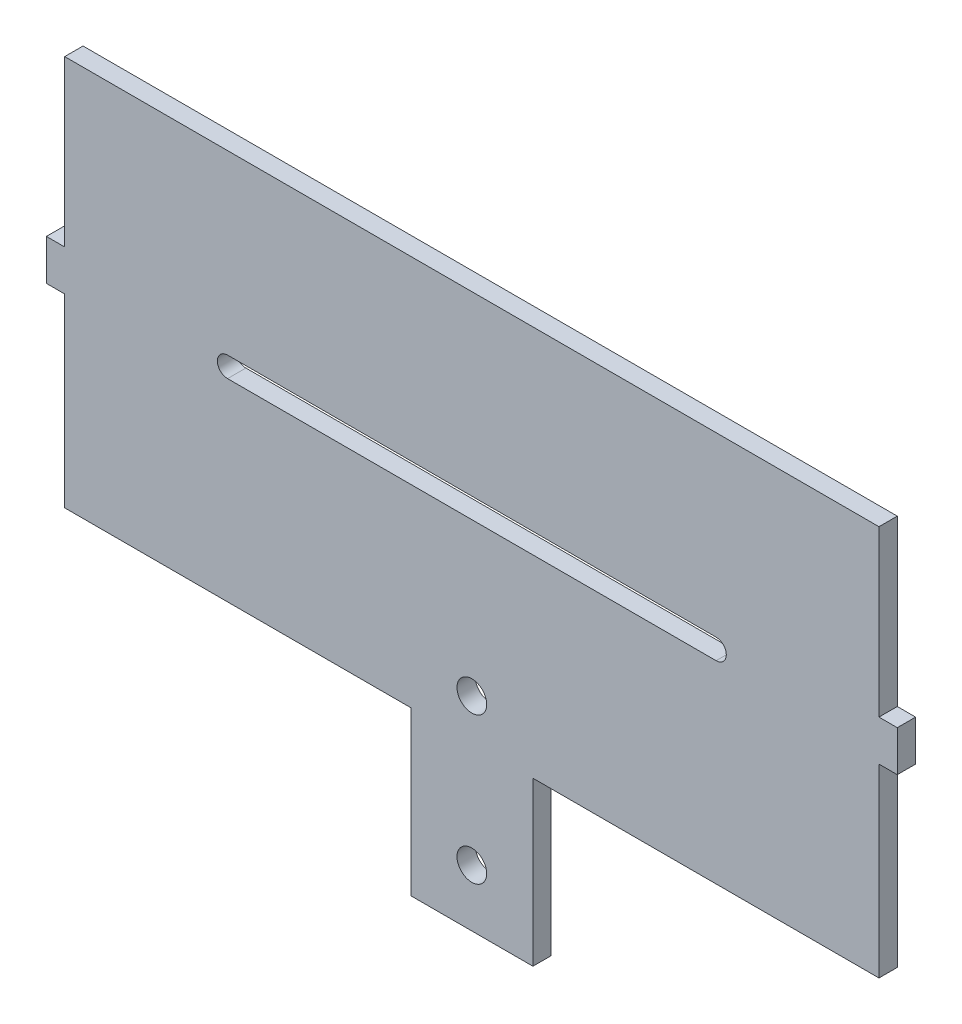
ISO-10303-21;
HEADER;
FILE_DESCRIPTION(('STEP AP214'),'2;1');
FILE_NAME('part.step','',(''),(''),'','','');
FILE_SCHEMA(('AUTOMOTIVE_DESIGN { 1 0 10303 214 1 1 1 1 }'));
ENDSEC;
DATA;
#1=APPLICATION_CONTEXT('core data for automotive mechanical design processes');
#2=APPLICATION_PROTOCOL_DEFINITION('international standard','automotive_design',2000,#1);
#3=PRODUCT_CONTEXT('',#1,'mechanical');
#4=PRODUCT('Part','Part','',(#3));
#5=PRODUCT_RELATED_PRODUCT_CATEGORY('part','',(#4));
#6=PRODUCT_DEFINITION_FORMATION('','',#4);
#7=PRODUCT_DEFINITION_CONTEXT('part definition',#1,'design');
#8=PRODUCT_DEFINITION('design','',#6,#7);
#9=PRODUCT_DEFINITION_SHAPE('','',#8);
#10=(LENGTH_UNIT() NAMED_UNIT(*) SI_UNIT(.MILLI.,.METRE.));
#11=(NAMED_UNIT(*) PLANE_ANGLE_UNIT() SI_UNIT($,.RADIAN.));
#12=(NAMED_UNIT(*) SI_UNIT($,.STERADIAN.) SOLID_ANGLE_UNIT());
#13=UNCERTAINTY_MEASURE_WITH_UNIT(LENGTH_MEASURE(1.E-05),#10,'distance_accuracy_value','');
#14=(GEOMETRIC_REPRESENTATION_CONTEXT(3) GLOBAL_UNCERTAINTY_ASSIGNED_CONTEXT((#13)) GLOBAL_UNIT_ASSIGNED_CONTEXT((#10,
#11,#12)) REPRESENTATION_CONTEXT('',''));
#15=CARTESIAN_POINT('',(0.,0.,0.));
#16=DIRECTION('',(0.,0.,1.));
#17=DIRECTION('',(1.,0.,0.));
#18=AXIS2_PLACEMENT_3D('',#15,#16,#17);
#19=CARTESIAN_POINT('',(127.,6.98499999999998,5.715));
#20=DIRECTION('',(-1.,0.,0.));
#21=DIRECTION('',(0.,0.,1.));
#22=AXIS2_PLACEMENT_3D('',#19,#20,#21);
#23=PLANE('',#22);
#24=DIRECTION('',(0.,1.,0.));
#25=VECTOR('',#24,1.);
#26=CARTESIAN_POINT('',(127.,6.98499999999998,0.));
#27=LINE('',#26,#25);
#28=CARTESIAN_POINT('',(127.,6.98499999999998,0.));
#29=VERTEX_POINT('',#28);
#30=CARTESIAN_POINT('',(127.,58.42,0.));
#31=VERTEX_POINT('',#30);
#32=EDGE_CURVE('E205',#29,#31,#27,.T.);
#33=ORIENTED_EDGE('',*,*,#32,.T.);
#34=DIRECTION('',(0.,0.,1.));
#35=VECTOR('',#34,1.);
#36=CARTESIAN_POINT('',(127.,58.42,0.));
#37=LINE('',#36,#35);
#38=CARTESIAN_POINT('',(127.,58.42,5.715));
#39=VERTEX_POINT('',#38);
#40=EDGE_CURVE('E60',#31,#39,#37,.T.);
#41=ORIENTED_EDGE('',*,*,#40,.T.);
#42=DIRECTION('',(0.,1.,0.));
#43=VECTOR('',#42,1.);
#44=CARTESIAN_POINT('',(127.,6.98499999999998,5.715));
#45=LINE('',#44,#43);
#46=CARTESIAN_POINT('',(127.,6.98499999999998,5.715));
#47=VERTEX_POINT('',#46);
#48=EDGE_CURVE('E252',#47,#39,#45,.T.);
#49=ORIENTED_EDGE('',*,*,#48,.F.);
#50=DIRECTION('',(0.,0.,-1.));
#51=VECTOR('',#50,1.);
#52=CARTESIAN_POINT('',(127.,6.98499999999998,5.715));
#53=LINE('',#52,#51);
#54=EDGE_CURVE('E253',#47,#29,#53,.T.);
#55=ORIENTED_EDGE('',*,*,#54,.T.);
#56=EDGE_LOOP('',(#33,#41,#49,#55));
#57=FACE_BOUND('',#56,.T.);
#58=ADVANCED_FACE('F45',(#57),#23,.F.);
#59=CARTESIAN_POINT('',(-127.,6.98499999999998,5.715));
#60=DIRECTION('',(1.,0.,0.));
#61=DIRECTION('',(0.,0.,-1.));
#62=AXIS2_PLACEMENT_3D('',#59,#60,#61);
#63=PLANE('',#62);
#64=DIRECTION('',(0.,-1.,0.));
#65=VECTOR('',#64,1.);
#66=CARTESIAN_POINT('',(-127.,6.98499999999998,5.715));
#67=LINE('',#66,#65);
#68=CARTESIAN_POINT('',(-127.,58.42,5.715));
#69=VERTEX_POINT('',#68);
#70=CARTESIAN_POINT('',(-127.,6.98499999999998,5.715));
#71=VERTEX_POINT('',#70);
#72=EDGE_CURVE('E196',#69,#71,#67,.T.);
#73=ORIENTED_EDGE('',*,*,#72,.F.);
#74=DIRECTION('',(0.,0.,1.));
#75=VECTOR('',#74,1.);
#76=CARTESIAN_POINT('',(-127.,58.42,0.));
#77=LINE('',#76,#75);
#78=CARTESIAN_POINT('',(-127.,58.42,0.));
#79=VERTEX_POINT('',#78);
#80=EDGE_CURVE('E182',#79,#69,#77,.T.);
#81=ORIENTED_EDGE('',*,*,#80,.F.);
#82=DIRECTION('',(0.,-1.,0.));
#83=VECTOR('',#82,1.);
#84=CARTESIAN_POINT('',(-127.,6.98499999999998,0.));
#85=LINE('',#84,#83);
#86=CARTESIAN_POINT('',(-127.,6.98499999999998,0.));
#87=VERTEX_POINT('',#86);
#88=EDGE_CURVE('E195',#79,#87,#85,.T.);
#89=ORIENTED_EDGE('',*,*,#88,.T.);
#90=DIRECTION('',(0.,0.,-1.));
#91=VECTOR('',#90,1.);
#92=CARTESIAN_POINT('',(-127.,6.98499999999998,5.715));
#93=LINE('',#92,#91);
#94=EDGE_CURVE('E11',#71,#87,#93,.T.);
#95=ORIENTED_EDGE('',*,*,#94,.F.);
#96=EDGE_LOOP('',(#73,#81,#89,#95));
#97=FACE_BOUND('',#96,.T.);
#98=ADVANCED_FACE('F193',(#97),#63,.F.);
#99=CARTESIAN_POINT('',(-132.715,6.98499999999998,5.715));
#100=DIRECTION('',(0.,-1.,0.));
#101=DIRECTION('',(0.,0.,-1.));
#102=AXIS2_PLACEMENT_3D('',#99,#100,#101);
#103=PLANE('',#102);
#104=DIRECTION('',(-1.,0.,0.));
#105=VECTOR('',#104,1.);
#106=CARTESIAN_POINT('',(-132.715,6.98499999999998,0.));
#107=LINE('',#106,#105);
#108=CARTESIAN_POINT('',(-132.715,6.98499999999998,0.));
#109=VERTEX_POINT('',#108);
#110=EDGE_CURVE('E203',#87,#109,#107,.T.);
#111=ORIENTED_EDGE('',*,*,#110,.T.);
#112=DIRECTION('',(0.,0.,-1.));
#113=VECTOR('',#112,1.);
#114=CARTESIAN_POINT('',(-132.715,6.98499999999998,5.715));
#115=LINE('',#114,#113);
#116=CARTESIAN_POINT('',(-132.715,6.98499999999998,5.715));
#117=VERTEX_POINT('',#116);
#118=EDGE_CURVE('E53',#117,#109,#115,.T.);
#119=ORIENTED_EDGE('',*,*,#118,.F.);
#120=DIRECTION('',(-1.,0.,0.));
#121=VECTOR('',#120,1.);
#122=CARTESIAN_POINT('',(-132.715,6.98499999999998,5.715));
#123=LINE('',#122,#121);
#124=EDGE_CURVE('E378',#71,#117,#123,.T.);
#125=ORIENTED_EDGE('',*,*,#124,.F.);
#126=ORIENTED_EDGE('',*,*,#94,.T.);
#127=EDGE_LOOP('',(#111,#119,#125,#126));
#128=FACE_BOUND('',#127,.T.);
#129=ADVANCED_FACE('F388',(#128),#103,.F.);
#130=CARTESIAN_POINT('',(-132.715,-5.71500000000002,5.715));
#131=DIRECTION('',(1.,0.,0.));
#132=DIRECTION('',(0.,0.,-1.));
#133=AXIS2_PLACEMENT_3D('',#130,#131,#132);
#134=PLANE('',#133);
#135=DIRECTION('',(0.,-1.,0.));
#136=VECTOR('',#135,1.);
#137=CARTESIAN_POINT('',(-132.715,-5.71500000000002,0.));
#138=LINE('',#137,#136);
#139=CARTESIAN_POINT('',(-132.715,-5.71500000000002,0.));
#140=VERTEX_POINT('',#139);
#141=EDGE_CURVE('E211',#109,#140,#138,.T.);
#142=ORIENTED_EDGE('',*,*,#141,.T.);
#143=DIRECTION('',(0.,0.,-1.));
#144=VECTOR('',#143,1.);
#145=CARTESIAN_POINT('',(-132.715,-5.71500000000002,5.715));
#146=LINE('',#145,#144);
#147=CARTESIAN_POINT('',(-132.715,-5.71500000000002,5.715));
#148=VERTEX_POINT('',#147);
#149=EDGE_CURVE('E298',#148,#140,#146,.T.);
#150=ORIENTED_EDGE('',*,*,#149,.F.);
#151=DIRECTION('',(0.,-1.,0.));
#152=VECTOR('',#151,1.);
#153=CARTESIAN_POINT('',(-132.715,-5.71500000000002,5.715));
#154=LINE('',#153,#152);
#155=EDGE_CURVE('E310',#117,#148,#154,.T.);
#156=ORIENTED_EDGE('',*,*,#155,.F.);
#157=ORIENTED_EDGE('',*,*,#118,.T.);
#158=EDGE_LOOP('',(#142,#150,#156,#157));
#159=FACE_BOUND('',#158,.T.);
#160=ADVANCED_FACE('F308',(#159),#134,.F.);
#161=CARTESIAN_POINT('',(-132.715,-5.71500000000002,5.715));
#162=DIRECTION('',(0.,1.,0.));
#163=DIRECTION('',(0.,0.,1.));
#164=AXIS2_PLACEMENT_3D('',#161,#162,#163);
#165=PLANE('',#164);
#166=DIRECTION('',(1.,0.,0.));
#167=VECTOR('',#166,1.);
#168=CARTESIAN_POINT('',(-132.715,-5.71500000000002,0.));
#169=LINE('',#168,#167);
#170=CARTESIAN_POINT('',(-127.,-5.71500000000002,0.));
#171=VERTEX_POINT('',#170);
#172=EDGE_CURVE('E219',#140,#171,#169,.T.);
#173=ORIENTED_EDGE('',*,*,#172,.T.);
#174=DIRECTION('',(0.,0.,-1.));
#175=VECTOR('',#174,1.);
#176=CARTESIAN_POINT('',(-127.,-5.71500000000002,5.715));
#177=LINE('',#176,#175);
#178=CARTESIAN_POINT('',(-127.,-5.71500000000002,5.715));
#179=VERTEX_POINT('',#178);
#180=EDGE_CURVE('E294',#179,#171,#177,.T.);
#181=ORIENTED_EDGE('',*,*,#180,.F.);
#182=DIRECTION('',(1.,0.,0.));
#183=VECTOR('',#182,1.);
#184=CARTESIAN_POINT('',(-132.715,-5.71500000000002,5.715));
#185=LINE('',#184,#183);
#186=EDGE_CURVE('E329',#148,#179,#185,.T.);
#187=ORIENTED_EDGE('',*,*,#186,.F.);
#188=ORIENTED_EDGE('',*,*,#149,.T.);
#189=EDGE_LOOP('',(#173,#181,#187,#188));
#190=FACE_BOUND('',#189,.T.);
#191=ADVANCED_FACE('F318',(#190),#165,.F.);
#192=CARTESIAN_POINT('',(-127.,-63.5,5.715));
#193=DIRECTION('',(1.,0.,0.));
#194=DIRECTION('',(0.,0.,-1.));
#195=AXIS2_PLACEMENT_3D('',#192,#193,#194);
#196=PLANE('',#195);
#197=DIRECTION('',(0.,-1.,0.));
#198=VECTOR('',#197,1.);
#199=CARTESIAN_POINT('',(-127.,-63.5,0.));
#200=LINE('',#199,#198);
#201=CARTESIAN_POINT('',(-127.,-63.5,0.));
#202=VERTEX_POINT('',#201);
#203=EDGE_CURVE('E222',#171,#202,#200,.T.);
#204=ORIENTED_EDGE('',*,*,#203,.T.);
#205=DIRECTION('',(0.,0.,-1.));
#206=VECTOR('',#205,1.);
#207=CARTESIAN_POINT('',(-127.,-63.5,5.715));
#208=LINE('',#207,#206);
#209=CARTESIAN_POINT('',(-127.,-63.5,5.715));
#210=VERTEX_POINT('',#209);
#211=EDGE_CURVE('E290',#210,#202,#208,.T.);
#212=ORIENTED_EDGE('',*,*,#211,.F.);
#213=DIRECTION('',(0.,-1.,0.));
#214=VECTOR('',#213,1.);
#215=CARTESIAN_POINT('',(-127.,-63.5,5.715));
#216=LINE('',#215,#214);
#217=EDGE_CURVE('E324',#179,#210,#216,.T.);
#218=ORIENTED_EDGE('',*,*,#217,.F.);
#219=ORIENTED_EDGE('',*,*,#180,.T.);
#220=EDGE_LOOP('',(#204,#212,#218,#219));
#221=FACE_BOUND('',#220,.T.);
#222=ADVANCED_FACE('F322',(#221),#196,.F.);
#223=CARTESIAN_POINT('',(-127.,-63.5,5.715));
#224=DIRECTION('',(0.,1.,0.));
#225=DIRECTION('',(-1.,0.,0.));
#226=AXIS2_PLACEMENT_3D('',#223,#224,#225);
#227=PLANE('',#226);
#228=DIRECTION('',(1.,0.,0.));
#229=VECTOR('',#228,1.);
#230=CARTESIAN_POINT('',(-127.,-63.5,0.));
#231=LINE('',#230,#229);
#232=CARTESIAN_POINT('',(-19.05,-63.5,0.));
#233=VERTEX_POINT('',#232);
#234=EDGE_CURVE('E225',#202,#233,#231,.T.);
#235=ORIENTED_EDGE('',*,*,#234,.T.);
#236=DIRECTION('',(0.,0.,-1.));
#237=VECTOR('',#236,1.);
#238=CARTESIAN_POINT('',(-19.05,-63.5,5.715));
#239=LINE('',#238,#237);
#240=CARTESIAN_POINT('',(-19.05,-63.5,5.715));
#241=VERTEX_POINT('',#240);
#242=EDGE_CURVE('E286',#241,#233,#239,.T.);
#243=ORIENTED_EDGE('',*,*,#242,.F.);
#244=DIRECTION('',(1.,0.,0.));
#245=VECTOR('',#244,1.);
#246=CARTESIAN_POINT('',(-127.,-63.5,5.715));
#247=LINE('',#246,#245);
#248=EDGE_CURVE('E328',#210,#241,#247,.T.);
#249=ORIENTED_EDGE('',*,*,#248,.F.);
#250=ORIENTED_EDGE('',*,*,#211,.T.);
#251=EDGE_LOOP('',(#235,#243,#249,#250));
#252=FACE_BOUND('',#251,.T.);
#253=ADVANCED_FACE('F576',(#252),#227,.F.);
#254=CARTESIAN_POINT('',(-19.05,-114.3,5.715));
#255=DIRECTION('',(1.,0.,0.));
#256=DIRECTION('',(0.,0.,-1.));
#257=AXIS2_PLACEMENT_3D('',#254,#255,#256);
#258=PLANE('',#257);
#259=DIRECTION('',(0.,-1.,0.));
#260=VECTOR('',#259,1.);
#261=CARTESIAN_POINT('',(-19.05,-114.3,0.));
#262=LINE('',#261,#260);
#263=CARTESIAN_POINT('',(-19.05,-114.3,0.));
#264=VERTEX_POINT('',#263);
#265=EDGE_CURVE('E228',#233,#264,#262,.T.);
#266=ORIENTED_EDGE('',*,*,#265,.T.);
#267=DIRECTION('',(0.,0.,-1.));
#268=VECTOR('',#267,1.);
#269=CARTESIAN_POINT('',(-19.05,-114.3,5.715));
#270=LINE('',#269,#268);
#271=CARTESIAN_POINT('',(-19.05,-114.3,5.715));
#272=VERTEX_POINT('',#271);
#273=EDGE_CURVE('E282',#272,#264,#270,.T.);
#274=ORIENTED_EDGE('',*,*,#273,.F.);
#275=DIRECTION('',(0.,-1.,0.));
#276=VECTOR('',#275,1.);
#277=CARTESIAN_POINT('',(-19.05,-114.3,5.715));
#278=LINE('',#277,#276);
#279=EDGE_CURVE('E335',#241,#272,#278,.T.);
#280=ORIENTED_EDGE('',*,*,#279,.F.);
#281=ORIENTED_EDGE('',*,*,#242,.T.);
#282=EDGE_LOOP('',(#266,#274,#280,#281));
#283=FACE_BOUND('',#282,.T.);
#284=ADVANCED_FACE('F566',(#283),#258,.F.);
#285=CARTESIAN_POINT('',(-19.05,-114.3,5.715));
#286=DIRECTION('',(0.,1.,0.));
#287=DIRECTION('',(0.,0.,1.));
#288=AXIS2_PLACEMENT_3D('',#285,#286,#287);
#289=PLANE('',#288);
#290=DIRECTION('',(1.,0.,0.));
#291=VECTOR('',#290,1.);
#292=CARTESIAN_POINT('',(-19.05,-114.3,0.));
#293=LINE('',#292,#291);
#294=CARTESIAN_POINT('',(19.05,-114.3,0.));
#295=VERTEX_POINT('',#294);
#296=EDGE_CURVE('E231',#264,#295,#293,.T.);
#297=ORIENTED_EDGE('',*,*,#296,.T.);
#298=DIRECTION('',(0.,0.,-1.));
#299=VECTOR('',#298,1.);
#300=CARTESIAN_POINT('',(19.05,-114.3,5.715));
#301=LINE('',#300,#299);
#302=CARTESIAN_POINT('',(19.05,-114.3,5.715));
#303=VERTEX_POINT('',#302);
#304=EDGE_CURVE('E278',#303,#295,#301,.T.);
#305=ORIENTED_EDGE('',*,*,#304,.F.);
#306=DIRECTION('',(1.,0.,0.));
#307=VECTOR('',#306,1.);
#308=CARTESIAN_POINT('',(-19.05,-114.3,5.715));
#309=LINE('',#308,#307);
#310=EDGE_CURVE('E342',#272,#303,#309,.T.);
#311=ORIENTED_EDGE('',*,*,#310,.F.);
#312=ORIENTED_EDGE('',*,*,#273,.T.);
#313=EDGE_LOOP('',(#297,#305,#311,#312));
#314=FACE_BOUND('',#313,.T.);
#315=ADVANCED_FACE('F556',(#314),#289,.F.);
#316=CARTESIAN_POINT('',(19.05,-114.3,5.715));
#317=DIRECTION('',(-1.,0.,0.));
#318=DIRECTION('',(0.,-1.,0.));
#319=AXIS2_PLACEMENT_3D('',#316,#317,#318);
#320=PLANE('',#319);
#321=DIRECTION('',(0.,1.,0.));
#322=VECTOR('',#321,1.);
#323=CARTESIAN_POINT('',(19.05,-114.3,0.));
#324=LINE('',#323,#322);
#325=CARTESIAN_POINT('',(19.05,-63.5,0.));
#326=VERTEX_POINT('',#325);
#327=EDGE_CURVE('E234',#295,#326,#324,.T.);
#328=ORIENTED_EDGE('',*,*,#327,.T.);
#329=DIRECTION('',(0.,0.,-1.));
#330=VECTOR('',#329,1.);
#331=CARTESIAN_POINT('',(19.05,-63.5,5.715));
#332=LINE('',#331,#330);
#333=CARTESIAN_POINT('',(19.05,-63.5,5.715));
#334=VERTEX_POINT('',#333);
#335=EDGE_CURVE('E274',#334,#326,#332,.T.);
#336=ORIENTED_EDGE('',*,*,#335,.F.);
#337=DIRECTION('',(0.,1.,0.));
#338=VECTOR('',#337,1.);
#339=CARTESIAN_POINT('',(19.05,-114.3,5.715));
#340=LINE('',#339,#338);
#341=EDGE_CURVE('E345',#303,#334,#340,.T.);
#342=ORIENTED_EDGE('',*,*,#341,.F.);
#343=ORIENTED_EDGE('',*,*,#304,.T.);
#344=EDGE_LOOP('',(#328,#336,#342,#343));
#345=FACE_BOUND('',#344,.T.);
#346=ADVANCED_FACE('F546',(#345),#320,.F.);
#347=CARTESIAN_POINT('',(19.05,-63.5,5.715));
#348=DIRECTION('',(0.,1.,0.));
#349=DIRECTION('',(-1.,0.,0.));
#350=AXIS2_PLACEMENT_3D('',#347,#348,#349);
#351=PLANE('',#350);
#352=DIRECTION('',(1.,0.,0.));
#353=VECTOR('',#352,1.);
#354=CARTESIAN_POINT('',(19.05,-63.5,0.));
#355=LINE('',#354,#353);
#356=CARTESIAN_POINT('',(127.,-63.5,0.));
#357=VERTEX_POINT('',#356);
#358=EDGE_CURVE('E237',#326,#357,#355,.T.);
#359=ORIENTED_EDGE('',*,*,#358,.T.);
#360=DIRECTION('',(0.,0.,-1.));
#361=VECTOR('',#360,1.);
#362=CARTESIAN_POINT('',(127.,-63.5,5.715));
#363=LINE('',#362,#361);
#364=CARTESIAN_POINT('',(127.,-63.5,5.715));
#365=VERTEX_POINT('',#364);
#366=EDGE_CURVE('E270',#365,#357,#363,.T.);
#367=ORIENTED_EDGE('',*,*,#366,.F.);
#368=DIRECTION('',(1.,0.,0.));
#369=VECTOR('',#368,1.);
#370=CARTESIAN_POINT('',(19.05,-63.5,5.715));
#371=LINE('',#370,#369);
#372=EDGE_CURVE('E348',#334,#365,#371,.T.);
#373=ORIENTED_EDGE('',*,*,#372,.F.);
#374=ORIENTED_EDGE('',*,*,#335,.T.);
#375=EDGE_LOOP('',(#359,#367,#373,#374));
#376=FACE_BOUND('',#375,.T.);
#377=ADVANCED_FACE('F536',(#376),#351,.F.);
#378=CARTESIAN_POINT('',(127.,-63.5,5.715));
#379=DIRECTION('',(-1.,0.,0.));
#380=DIRECTION('',(0.,0.,1.));
#381=AXIS2_PLACEMENT_3D('',#378,#379,#380);
#382=PLANE('',#381);
#383=DIRECTION('',(0.,1.,0.));
#384=VECTOR('',#383,1.);
#385=CARTESIAN_POINT('',(127.,-63.5,0.));
#386=LINE('',#385,#384);
#387=CARTESIAN_POINT('',(127.,-5.71500000000002,0.));
#388=VERTEX_POINT('',#387);
#389=EDGE_CURVE('E240',#357,#388,#386,.T.);
#390=ORIENTED_EDGE('',*,*,#389,.T.);
#391=DIRECTION('',(0.,0.,-1.));
#392=VECTOR('',#391,1.);
#393=CARTESIAN_POINT('',(127.,-5.71500000000002,5.715));
#394=LINE('',#393,#392);
#395=CARTESIAN_POINT('',(127.,-5.71500000000002,5.715));
#396=VERTEX_POINT('',#395);
#397=EDGE_CURVE('E266',#396,#388,#394,.T.);
#398=ORIENTED_EDGE('',*,*,#397,.F.);
#399=DIRECTION('',(0.,1.,0.));
#400=VECTOR('',#399,1.);
#401=CARTESIAN_POINT('',(127.,-63.5,5.715));
#402=LINE('',#401,#400);
#403=EDGE_CURVE('E351',#365,#396,#402,.T.);
#404=ORIENTED_EDGE('',*,*,#403,.F.);
#405=ORIENTED_EDGE('',*,*,#366,.T.);
#406=EDGE_LOOP('',(#390,#398,#404,#405));
#407=FACE_BOUND('',#406,.T.);
#408=ADVANCED_FACE('F526',(#407),#382,.F.);
#409=CARTESIAN_POINT('',(132.715,-5.71500000000002,5.715));
#410=DIRECTION('',(0.,1.,0.));
#411=DIRECTION('',(0.,0.,1.));
#412=AXIS2_PLACEMENT_3D('',#409,#410,#411);
#413=PLANE('',#412);
#414=DIRECTION('',(1.,0.,0.));
#415=VECTOR('',#414,1.);
#416=CARTESIAN_POINT('',(132.715,-5.71500000000002,0.));
#417=LINE('',#416,#415);
#418=CARTESIAN_POINT('',(132.715,-5.71500000000002,0.));
#419=VERTEX_POINT('',#418);
#420=EDGE_CURVE('E243',#388,#419,#417,.T.);
#421=ORIENTED_EDGE('',*,*,#420,.T.);
#422=DIRECTION('',(0.,0.,-1.));
#423=VECTOR('',#422,1.);
#424=CARTESIAN_POINT('',(132.715,-5.71500000000002,5.715));
#425=LINE('',#424,#423);
#426=CARTESIAN_POINT('',(132.715,-5.71500000000002,5.715));
#427=VERTEX_POINT('',#426);
#428=EDGE_CURVE('E262',#427,#419,#425,.T.);
#429=ORIENTED_EDGE('',*,*,#428,.F.);
#430=DIRECTION('',(1.,0.,0.));
#431=VECTOR('',#430,1.);
#432=CARTESIAN_POINT('',(132.715,-5.71500000000002,5.715));
#433=LINE('',#432,#431);
#434=EDGE_CURVE('E354',#396,#427,#433,.T.);
#435=ORIENTED_EDGE('',*,*,#434,.F.);
#436=ORIENTED_EDGE('',*,*,#397,.T.);
#437=EDGE_LOOP('',(#421,#429,#435,#436));
#438=FACE_BOUND('',#437,.T.);
#439=ADVANCED_FACE('F516',(#438),#413,.F.);
#440=CARTESIAN_POINT('',(132.715,-5.71500000000002,5.715));
#441=DIRECTION('',(-1.,0.,0.));
#442=DIRECTION('',(0.,0.,1.));
#443=AXIS2_PLACEMENT_3D('',#440,#441,#442);
#444=PLANE('',#443);
#445=DIRECTION('',(0.,1.,0.));
#446=VECTOR('',#445,1.);
#447=CARTESIAN_POINT('',(132.715,-5.71500000000002,0.));
#448=LINE('',#447,#446);
#449=CARTESIAN_POINT('',(132.715,6.98499999999998,0.));
#450=VERTEX_POINT('',#449);
#451=EDGE_CURVE('E246',#419,#450,#448,.T.);
#452=ORIENTED_EDGE('',*,*,#451,.T.);
#453=DIRECTION('',(0.,0.,-1.));
#454=VECTOR('',#453,1.);
#455=CARTESIAN_POINT('',(132.715,6.98499999999998,5.715));
#456=LINE('',#455,#454);
#457=CARTESIAN_POINT('',(132.715,6.98499999999998,5.715));
#458=VERTEX_POINT('',#457);
#459=EDGE_CURVE('E257',#458,#450,#456,.T.);
#460=ORIENTED_EDGE('',*,*,#459,.F.);
#461=DIRECTION('',(0.,1.,0.));
#462=VECTOR('',#461,1.);
#463=CARTESIAN_POINT('',(132.715,-5.71500000000002,5.715));
#464=LINE('',#463,#462);
#465=EDGE_CURVE('E357',#427,#458,#464,.T.);
#466=ORIENTED_EDGE('',*,*,#465,.F.);
#467=ORIENTED_EDGE('',*,*,#428,.T.);
#468=EDGE_LOOP('',(#452,#460,#466,#467));
#469=FACE_BOUND('',#468,.T.);
#470=ADVANCED_FACE('F507',(#469),#444,.F.);
#471=CARTESIAN_POINT('',(132.715,6.98499999999998,5.715));
#472=DIRECTION('',(0.,-1.,0.));
#473=DIRECTION('',(0.,0.,-1.));
#474=AXIS2_PLACEMENT_3D('',#471,#472,#473);
#475=PLANE('',#474);
#476=DIRECTION('',(-1.,0.,0.));
#477=VECTOR('',#476,1.);
#478=CARTESIAN_POINT('',(132.715,6.98499999999998,0.));
#479=LINE('',#478,#477);
#480=EDGE_CURVE('E249',#450,#29,#479,.T.);
#481=ORIENTED_EDGE('',*,*,#480,.T.);
#482=ORIENTED_EDGE('',*,*,#54,.F.);
#483=DIRECTION('',(-1.,0.,0.));
#484=VECTOR('',#483,1.);
#485=CARTESIAN_POINT('',(132.715,6.98499999999998,5.715));
#486=LINE('',#485,#484);
#487=EDGE_CURVE('E258',#458,#47,#486,.T.);
#488=ORIENTED_EDGE('',*,*,#487,.F.);
#489=ORIENTED_EDGE('',*,*,#459,.T.);
#490=EDGE_LOOP('',(#481,#482,#488,#489));
#491=FACE_BOUND('',#490,.T.);
#492=ADVANCED_FACE('F370',(#491),#475,.F.);
#493=CARTESIAN_POINT('',(0.,0.,5.715));
#494=DIRECTION('',(0.,0.,-1.));
#495=DIRECTION('',(-1.,0.,0.));
#496=AXIS2_PLACEMENT_3D('',#493,#494,#495);
#497=PLANE('',#496);
#498=CARTESIAN_POINT('',(0.,-96.52,5.715));
#499=DIRECTION('',(0.,0.,1.));
#500=DIRECTION('',(1.,0.,0.));
#501=AXIS2_PLACEMENT_3D('',#498,#499,#500);
#502=CIRCLE('',#501,4.6355);
#503=CARTESIAN_POINT('',(4.6355,-96.52,5.715));
#504=VERTEX_POINT('',#503);
#505=EDGE_CURVE('E747',#504,#504,#502,.T.);
#506=ORIENTED_EDGE('',*,*,#505,.F.);
#507=EDGE_LOOP('',(#506));
#508=FACE_BOUND('',#507,.T.);
#509=CARTESIAN_POINT('',(0.,-50.8,5.715));
#510=DIRECTION('',(0.,0.,1.));
#511=DIRECTION('',(1.,0.,0.));
#512=AXIS2_PLACEMENT_3D('',#509,#510,#511);
#513=CIRCLE('',#512,4.6355);
#514=CARTESIAN_POINT('',(4.6355,-50.8,5.715));
#515=VERTEX_POINT('',#514);
#516=EDGE_CURVE('E701',#515,#515,#513,.T.);
#517=ORIENTED_EDGE('',*,*,#516,.F.);
#518=EDGE_LOOP('',(#517));
#519=FACE_BOUND('',#518,.T.);
#520=DIRECTION('',(-1.,0.,0.));
#521=VECTOR('',#520,1.);
#522=CARTESIAN_POINT('',(76.2,3.17500000000003,5.715));
#523=LINE('',#522,#521);
#524=CARTESIAN_POINT('',(76.2,3.17500000000003,5.715));
#525=VERTEX_POINT('',#524);
#526=CARTESIAN_POINT('',(-76.2,3.17499999999998,5.715));
#527=VERTEX_POINT('',#526);
#528=EDGE_CURVE('E691',#525,#527,#523,.T.);
#529=ORIENTED_EDGE('',*,*,#528,.F.);
#530=CARTESIAN_POINT('',(76.2,0.,5.715));
#531=DIRECTION('',(0.,0.,1.));
#532=DIRECTION('',(1.,0.,0.));
#533=AXIS2_PLACEMENT_3D('',#530,#531,#532);
#534=CIRCLE('',#533,3.175);
#535=CARTESIAN_POINT('',(76.2,-3.17499999999997,5.715));
#536=VERTEX_POINT('',#535);
#537=EDGE_CURVE('E68',#536,#525,#534,.T.);
#538=ORIENTED_EDGE('',*,*,#537,.F.);
#539=DIRECTION('',(1.,0.,0.));
#540=VECTOR('',#539,1.);
#541=CARTESIAN_POINT('',(76.2,-3.17499999999997,5.715));
#542=LINE('',#541,#540);
#543=CARTESIAN_POINT('',(-76.2,-3.17500000000002,5.715));
#544=VERTEX_POINT('',#543);
#545=EDGE_CURVE('E678',#544,#536,#542,.T.);
#546=ORIENTED_EDGE('',*,*,#545,.F.);
#547=CARTESIAN_POINT('',(-76.2,0.,5.715));
#548=DIRECTION('',(0.,0.,1.));
#549=DIRECTION('',(1.,0.,0.));
#550=AXIS2_PLACEMENT_3D('',#547,#548,#549);
#551=CIRCLE('',#550,3.175);
#552=EDGE_CURVE('E687',#527,#544,#551,.T.);
#553=ORIENTED_EDGE('',*,*,#552,.F.);
#554=EDGE_LOOP('',(#529,#538,#546,#553));
#555=FACE_BOUND('',#554,.T.);
#556=ORIENTED_EDGE('',*,*,#48,.T.);
#557=DIRECTION('',(1.,0.,0.));
#558=VECTOR('',#557,1.);
#559=CARTESIAN_POINT('',(-127.,58.42,5.715));
#560=LINE('',#559,#558);
#561=EDGE_CURVE('E189',#69,#39,#560,.T.);
#562=ORIENTED_EDGE('',*,*,#561,.F.);
#563=ORIENTED_EDGE('',*,*,#72,.T.);
#564=ORIENTED_EDGE('',*,*,#124,.T.);
#565=ORIENTED_EDGE('',*,*,#155,.T.);
#566=ORIENTED_EDGE('',*,*,#186,.T.);
#567=ORIENTED_EDGE('',*,*,#217,.T.);
#568=ORIENTED_EDGE('',*,*,#248,.T.);
#569=ORIENTED_EDGE('',*,*,#279,.T.);
#570=ORIENTED_EDGE('',*,*,#310,.T.);
#571=ORIENTED_EDGE('',*,*,#341,.T.);
#572=ORIENTED_EDGE('',*,*,#372,.T.);
#573=ORIENTED_EDGE('',*,*,#403,.T.);
#574=ORIENTED_EDGE('',*,*,#434,.T.);
#575=ORIENTED_EDGE('',*,*,#465,.T.);
#576=ORIENTED_EDGE('',*,*,#487,.T.);
#577=EDGE_LOOP('',(#556,#562,#563,#564,#565,#566,#567,#568,#569,#570,#571,#572,#573,#574,#575,#576));
#578=FACE_BOUND('',#577,.T.);
#579=ADVANCED_FACE('F365',(#508,#519,#555,#578),#497,.F.);
#580=CARTESIAN_POINT('',(0.,0.,0.));
#581=DIRECTION('',(0.,0.,-1.));
#582=DIRECTION('',(-1.,0.,0.));
#583=AXIS2_PLACEMENT_3D('',#580,#581,#582);
#584=PLANE('',#583);
#585=CARTESIAN_POINT('',(0.,-96.52,0.));
#586=DIRECTION('',(0.,0.,1.));
#587=DIRECTION('',(1.,0.,0.));
#588=AXIS2_PLACEMENT_3D('',#585,#586,#587);
#589=CIRCLE('',#588,4.6355);
#590=CARTESIAN_POINT('',(4.6355,-96.52,0.));
#591=VERTEX_POINT('',#590);
#592=EDGE_CURVE('E745',#591,#591,#589,.T.);
#593=ORIENTED_EDGE('',*,*,#592,.T.);
#594=EDGE_LOOP('',(#593));
#595=FACE_BOUND('',#594,.T.);
#596=DIRECTION('',(1.,0.,0.));
#597=VECTOR('',#596,1.);
#598=CARTESIAN_POINT('',(-127.,58.42,0.));
#599=LINE('',#598,#597);
#600=EDGE_CURVE('E179',#79,#31,#599,.T.);
#601=ORIENTED_EDGE('',*,*,#600,.T.);
#602=ORIENTED_EDGE('',*,*,#32,.F.);
#603=ORIENTED_EDGE('',*,*,#480,.F.);
#604=ORIENTED_EDGE('',*,*,#451,.F.);
#605=ORIENTED_EDGE('',*,*,#420,.F.);
#606=ORIENTED_EDGE('',*,*,#389,.F.);
#607=ORIENTED_EDGE('',*,*,#358,.F.);
#608=ORIENTED_EDGE('',*,*,#327,.F.);
#609=ORIENTED_EDGE('',*,*,#296,.F.);
#610=ORIENTED_EDGE('',*,*,#265,.F.);
#611=ORIENTED_EDGE('',*,*,#234,.F.);
#612=ORIENTED_EDGE('',*,*,#203,.F.);
#613=ORIENTED_EDGE('',*,*,#172,.F.);
#614=ORIENTED_EDGE('',*,*,#141,.F.);
#615=ORIENTED_EDGE('',*,*,#110,.F.);
#616=ORIENTED_EDGE('',*,*,#88,.F.);
#617=EDGE_LOOP('',(#601,#602,#603,#604,#605,#606,#607,#608,#609,#610,#611,#612,#613,#614,#615,#616));
#618=FACE_BOUND('',#617,.T.);
#619=CARTESIAN_POINT('',(0.,-50.8,0.));
#620=DIRECTION('',(0.,0.,1.));
#621=DIRECTION('',(1.,0.,0.));
#622=AXIS2_PLACEMENT_3D('',#619,#620,#621);
#623=CIRCLE('',#622,4.6355);
#624=CARTESIAN_POINT('',(4.6355,-50.8,0.));
#625=VERTEX_POINT('',#624);
#626=EDGE_CURVE('E693',#625,#625,#623,.T.);
#627=ORIENTED_EDGE('',*,*,#626,.T.);
#628=EDGE_LOOP('',(#627));
#629=FACE_BOUND('',#628,.T.);
#630=CARTESIAN_POINT('',(76.2,0.,0.));
#631=DIRECTION('',(0.,0.,1.));
#632=DIRECTION('',(1.,0.,0.));
#633=AXIS2_PLACEMENT_3D('',#630,#631,#632);
#634=CIRCLE('',#633,3.175);
#635=CARTESIAN_POINT('',(76.2,-3.17499999999997,0.));
#636=VERTEX_POINT('',#635);
#637=CARTESIAN_POINT('',(76.2,3.17500000000003,0.));
#638=VERTEX_POINT('',#637);
#639=EDGE_CURVE('E686',#636,#638,#634,.T.);
#640=ORIENTED_EDGE('',*,*,#639,.T.);
#641=DIRECTION('',(-1.,0.,0.));
#642=VECTOR('',#641,1.);
#643=CARTESIAN_POINT('',(76.2,3.17500000000003,0.));
#644=LINE('',#643,#642);
#645=CARTESIAN_POINT('',(-76.2,3.17499999999998,0.));
#646=VERTEX_POINT('',#645);
#647=EDGE_CURVE('E730',#638,#646,#644,.T.);
#648=ORIENTED_EDGE('',*,*,#647,.T.);
#649=CARTESIAN_POINT('',(-76.2,0.,0.));
#650=DIRECTION('',(0.,0.,1.));
#651=DIRECTION('',(1.,0.,0.));
#652=AXIS2_PLACEMENT_3D('',#649,#650,#651);
#653=CIRCLE('',#652,3.175);
#654=CARTESIAN_POINT('',(-76.2,-3.17500000000002,0.));
#655=VERTEX_POINT('',#654);
#656=EDGE_CURVE('E723',#646,#655,#653,.T.);
#657=ORIENTED_EDGE('',*,*,#656,.T.);
#658=DIRECTION('',(1.,0.,0.));
#659=VECTOR('',#658,1.);
#660=CARTESIAN_POINT('',(76.2,-3.17499999999997,0.));
#661=LINE('',#660,#659);
#662=EDGE_CURVE('E704',#655,#636,#661,.T.);
#663=ORIENTED_EDGE('',*,*,#662,.T.);
#664=EDGE_LOOP('',(#640,#648,#657,#663));
#665=FACE_BOUND('',#664,.T.);
#666=ADVANCED_FACE('F200',(#595,#618,#629,#665),#584,.T.);
#667=CARTESIAN_POINT('',(76.2,0.,0.));
#668=DIRECTION('',(0.,0.,1.));
#669=DIRECTION('',(1.,0.,0.));
#670=AXIS2_PLACEMENT_3D('',#667,#668,#669);
#671=CYLINDRICAL_SURFACE('',#670,3.175);
#672=ORIENTED_EDGE('',*,*,#537,.T.);
#673=DIRECTION('',(0.,0.,1.));
#674=VECTOR('',#673,1.);
#675=CARTESIAN_POINT('',(76.2,3.17500000000003,0.));
#676=LINE('',#675,#674);
#677=EDGE_CURVE('E381',#638,#525,#676,.T.);
#678=ORIENTED_EDGE('',*,*,#677,.F.);
#679=ORIENTED_EDGE('',*,*,#639,.F.);
#680=DIRECTION('',(0.,0.,1.));
#681=VECTOR('',#680,1.);
#682=CARTESIAN_POINT('',(76.2,-3.17499999999997,0.));
#683=LINE('',#682,#681);
#684=EDGE_CURVE('E213',#636,#536,#683,.T.);
#685=ORIENTED_EDGE('',*,*,#684,.T.);
#686=EDGE_LOOP('',(#672,#678,#679,#685));
#687=FACE_BOUND('',#686,.T.);
#688=ADVANCED_FACE('F442',(#687),#671,.F.);
#689=CARTESIAN_POINT('',(76.2,-3.17499999999997,0.));
#690=DIRECTION('',(0.,-1.,0.));
#691=DIRECTION('',(1.,0.,0.));
#692=AXIS2_PLACEMENT_3D('',#689,#690,#691);
#693=PLANE('',#692);
#694=ORIENTED_EDGE('',*,*,#545,.T.);
#695=ORIENTED_EDGE('',*,*,#684,.F.);
#696=ORIENTED_EDGE('',*,*,#662,.F.);
#697=DIRECTION('',(0.,0.,1.));
#698=VECTOR('',#697,1.);
#699=CARTESIAN_POINT('',(-76.2,-3.17500000000002,0.));
#700=LINE('',#699,#698);
#701=EDGE_CURVE('E681',#655,#544,#700,.T.);
#702=ORIENTED_EDGE('',*,*,#701,.T.);
#703=EDGE_LOOP('',(#694,#695,#696,#702));
#704=FACE_BOUND('',#703,.T.);
#705=ADVANCED_FACE('F482',(#704),#693,.F.);
#706=CARTESIAN_POINT('',(-76.2,0.,0.));
#707=DIRECTION('',(0.,0.,1.));
#708=DIRECTION('',(1.,0.,0.));
#709=AXIS2_PLACEMENT_3D('',#706,#707,#708);
#710=CYLINDRICAL_SURFACE('',#709,3.175);
#711=ORIENTED_EDGE('',*,*,#552,.T.);
#712=ORIENTED_EDGE('',*,*,#701,.F.);
#713=ORIENTED_EDGE('',*,*,#656,.F.);
#714=DIRECTION('',(0.,0.,1.));
#715=VECTOR('',#714,1.);
#716=CARTESIAN_POINT('',(-76.2,3.17499999999998,0.));
#717=LINE('',#716,#715);
#718=EDGE_CURVE('E712',#646,#527,#717,.T.);
#719=ORIENTED_EDGE('',*,*,#718,.T.);
#720=EDGE_LOOP('',(#711,#712,#713,#719));
#721=FACE_BOUND('',#720,.T.);
#722=ADVANCED_FACE('F472',(#721),#710,.F.);
#723=CARTESIAN_POINT('',(76.2,3.17500000000003,0.));
#724=DIRECTION('',(0.,1.,0.));
#725=DIRECTION('',(-1.,0.,0.));
#726=AXIS2_PLACEMENT_3D('',#723,#724,#725);
#727=PLANE('',#726);
#728=ORIENTED_EDGE('',*,*,#528,.T.);
#729=ORIENTED_EDGE('',*,*,#718,.F.);
#730=ORIENTED_EDGE('',*,*,#647,.F.);
#731=ORIENTED_EDGE('',*,*,#677,.T.);
#732=EDGE_LOOP('',(#728,#729,#730,#731));
#733=FACE_BOUND('',#732,.T.);
#734=ADVANCED_FACE('F463',(#733),#727,.F.);
#735=CARTESIAN_POINT('',(0.,-50.8,0.));
#736=DIRECTION('',(0.,0.,1.));
#737=DIRECTION('',(1.,0.,0.));
#738=AXIS2_PLACEMENT_3D('',#735,#736,#737);
#739=CYLINDRICAL_SURFACE('',#738,4.6355);
#740=ORIENTED_EDGE('',*,*,#626,.F.);
#741=EDGE_LOOP('',(#740));
#742=FACE_BOUND('',#741,.T.);
#743=ORIENTED_EDGE('',*,*,#516,.T.);
#744=EDGE_LOOP('',(#743));
#745=FACE_BOUND('',#744,.T.);
#746=ADVANCED_FACE('F416',(#742,#745),#739,.F.);
#747=CARTESIAN_POINT('',(-127.,58.42,0.));
#748=DIRECTION('',(0.,-1.,0.));
#749=DIRECTION('',(0.,0.,-1.));
#750=AXIS2_PLACEMENT_3D('',#747,#748,#749);
#751=PLANE('',#750);
#752=ORIENTED_EDGE('',*,*,#561,.T.);
#753=ORIENTED_EDGE('',*,*,#40,.F.);
#754=ORIENTED_EDGE('',*,*,#600,.F.);
#755=ORIENTED_EDGE('',*,*,#80,.T.);
#756=EDGE_LOOP('',(#752,#753,#754,#755));
#757=FACE_BOUND('',#756,.T.);
#758=ADVANCED_FACE('F181',(#757),#751,.F.);
#759=CARTESIAN_POINT('',(0.,-96.52,0.));
#760=DIRECTION('',(0.,0.,1.));
#761=DIRECTION('',(1.,0.,0.));
#762=AXIS2_PLACEMENT_3D('',#759,#760,#761);
#763=CYLINDRICAL_SURFACE('',#762,4.6355);
#764=ORIENTED_EDGE('',*,*,#592,.F.);
#765=EDGE_LOOP('',(#764));
#766=FACE_BOUND('',#765,.T.);
#767=ORIENTED_EDGE('',*,*,#505,.T.);
#768=EDGE_LOOP('',(#767));
#769=FACE_BOUND('',#768,.T.);
#770=ADVANCED_FACE('F415',(#766,#769),#763,.F.);
#771=CLOSED_SHELL('',(#58,#98,#129,#160,#191,#222,#253,#284,#315,#346,#377,#408,#439,#470,#492,
#579,#666,#688,#705,#722,#734,#746,#758,#770));
#772=MANIFOLD_SOLID_BREP('B2',#771);
#773=ADVANCED_BREP_SHAPE_REPRESENTATION('',(#18,#772),#14);
#774=SHAPE_DEFINITION_REPRESENTATION(#9,#773);
ENDSEC;
END-ISO-10303-21;
